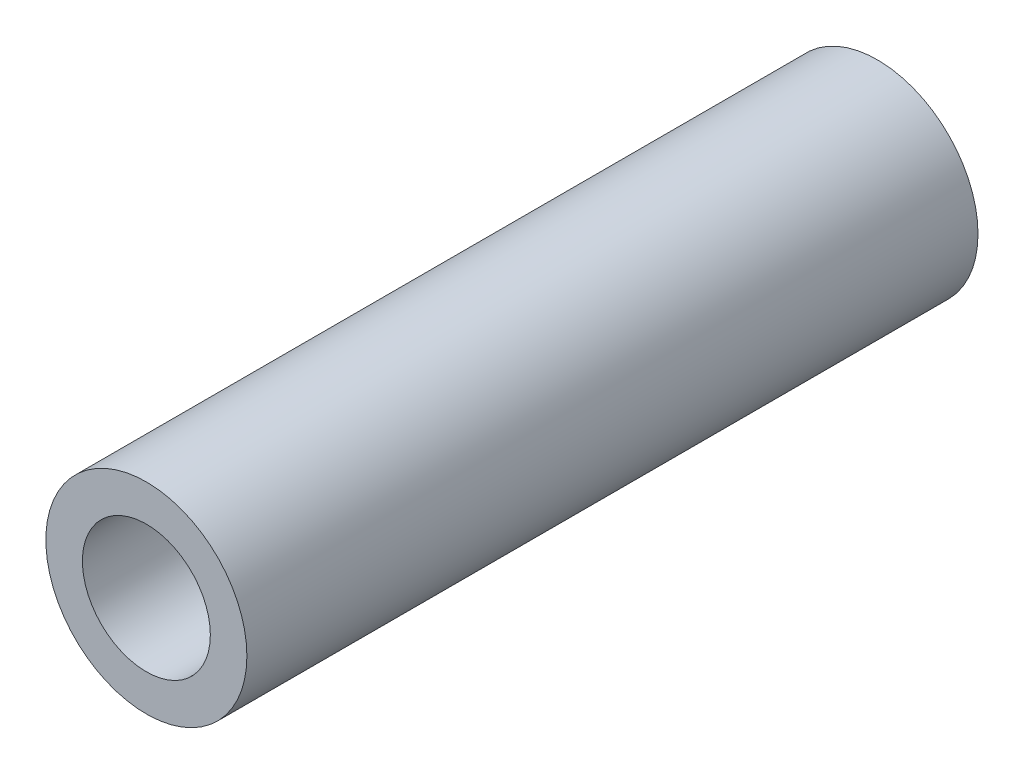
ISO-10303-21;
HEADER;
FILE_DESCRIPTION(('STEP AP214'),'2;1');
FILE_NAME('part.step','',(''),(''),'','','');
FILE_SCHEMA(('AUTOMOTIVE_DESIGN { 1 0 10303 214 1 1 1 1 }'));
ENDSEC;
DATA;
#1=APPLICATION_CONTEXT('core data for automotive mechanical design processes');
#2=APPLICATION_PROTOCOL_DEFINITION('international standard','automotive_design',2000,#1);
#3=PRODUCT_CONTEXT('',#1,'mechanical');
#4=PRODUCT('Part','Part','',(#3));
#5=PRODUCT_RELATED_PRODUCT_CATEGORY('part','',(#4));
#6=PRODUCT_DEFINITION_FORMATION('','',#4);
#7=PRODUCT_DEFINITION_CONTEXT('part definition',#1,'design');
#8=PRODUCT_DEFINITION('design','',#6,#7);
#9=PRODUCT_DEFINITION_SHAPE('','',#8);
#10=(LENGTH_UNIT() NAMED_UNIT(*) SI_UNIT(.MILLI.,.METRE.));
#11=(NAMED_UNIT(*) PLANE_ANGLE_UNIT() SI_UNIT($,.RADIAN.));
#12=(NAMED_UNIT(*) SI_UNIT($,.STERADIAN.) SOLID_ANGLE_UNIT());
#13=UNCERTAINTY_MEASURE_WITH_UNIT(LENGTH_MEASURE(1.E-05),#10,'distance_accuracy_value','');
#14=(GEOMETRIC_REPRESENTATION_CONTEXT(3) GLOBAL_UNCERTAINTY_ASSIGNED_CONTEXT((#13)) GLOBAL_UNIT_ASSIGNED_CONTEXT((#10,
#11,#12)) REPRESENTATION_CONTEXT('',''));
#15=CARTESIAN_POINT('',(0.,0.,0.));
#16=DIRECTION('',(0.,0.,1.));
#17=DIRECTION('',(1.,0.,0.));
#18=AXIS2_PLACEMENT_3D('',#15,#16,#17);
#19=CARTESIAN_POINT('',(0.,0.,20.));
#20=DIRECTION('',(0.,0.,1.));
#21=DIRECTION('',(1.,0.,0.));
#22=AXIS2_PLACEMENT_3D('',#19,#20,#21);
#23=PLANE('',#22);
#24=CARTESIAN_POINT('',(0.,0.,20.));
#25=DIRECTION('',(0.,0.,1.));
#26=DIRECTION('',(1.,0.,0.));
#27=AXIS2_PLACEMENT_3D('',#24,#25,#26);
#28=CIRCLE('',#27,2.75);
#29=CARTESIAN_POINT('',(2.75,0.,20.));
#30=VERTEX_POINT('',#29);
#31=EDGE_CURVE('E10',#30,#30,#28,.T.);
#32=ORIENTED_EDGE('',*,*,#31,.T.);
#33=EDGE_LOOP('',(#32));
#34=FACE_BOUND('',#33,.T.);
#35=CARTESIAN_POINT('',(0.,0.,20.));
#36=DIRECTION('',(0.,0.,1.));
#37=DIRECTION('',(1.,0.,0.));
#38=AXIS2_PLACEMENT_3D('',#35,#36,#37);
#39=CIRCLE('',#38,1.75);
#40=CARTESIAN_POINT('',(1.75,0.,20.));
#41=VERTEX_POINT('',#40);
#42=EDGE_CURVE('E52',#41,#41,#39,.T.);
#43=ORIENTED_EDGE('',*,*,#42,.F.);
#44=EDGE_LOOP('',(#43));
#45=FACE_BOUND('',#44,.T.);
#46=ADVANCED_FACE('F39',(#34,#45),#23,.T.);
#47=CARTESIAN_POINT('',(0.,0.,0.));
#48=DIRECTION('',(0.,0.,1.));
#49=DIRECTION('',(1.,0.,0.));
#50=AXIS2_PLACEMENT_3D('',#47,#48,#49);
#51=PLANE('',#50);
#52=CARTESIAN_POINT('',(0.,0.,0.));
#53=DIRECTION('',(0.,0.,1.));
#54=DIRECTION('',(1.,0.,0.));
#55=AXIS2_PLACEMENT_3D('',#52,#53,#54);
#56=CIRCLE('',#55,2.75);
#57=CARTESIAN_POINT('',(2.75,0.,0.));
#58=VERTEX_POINT('',#57);
#59=EDGE_CURVE('E43',#58,#58,#56,.T.);
#60=ORIENTED_EDGE('',*,*,#59,.F.);
#61=EDGE_LOOP('',(#60));
#62=FACE_BOUND('',#61,.T.);
#63=CARTESIAN_POINT('',(0.,0.,0.));
#64=DIRECTION('',(0.,0.,1.));
#65=DIRECTION('',(1.,0.,0.));
#66=AXIS2_PLACEMENT_3D('',#63,#64,#65);
#67=CIRCLE('',#66,1.75);
#68=CARTESIAN_POINT('',(1.75,0.,0.));
#69=VERTEX_POINT('',#68);
#70=EDGE_CURVE('E54',#69,#69,#67,.T.);
#71=ORIENTED_EDGE('',*,*,#70,.T.);
#72=EDGE_LOOP('',(#71));
#73=FACE_BOUND('',#72,.T.);
#74=ADVANCED_FACE('F66',(#62,#73),#51,.F.);
#75=CARTESIAN_POINT('',(0.,0.,20.));
#76=DIRECTION('',(0.,0.,-1.));
#77=DIRECTION('',(-1.,0.,0.));
#78=AXIS2_PLACEMENT_3D('',#75,#76,#77);
#79=CYLINDRICAL_SURFACE('',#78,2.75);
#80=ORIENTED_EDGE('',*,*,#31,.F.);
#81=EDGE_LOOP('',(#80));
#82=FACE_BOUND('',#81,.T.);
#83=ORIENTED_EDGE('',*,*,#59,.T.);
#84=EDGE_LOOP('',(#83));
#85=FACE_BOUND('',#84,.T.);
#86=ADVANCED_FACE('F41',(#82,#85),#79,.T.);
#87=CARTESIAN_POINT('',(0.,0.,20.));
#88=DIRECTION('',(0.,0.,-1.));
#89=DIRECTION('',(-1.,0.,0.));
#90=AXIS2_PLACEMENT_3D('',#87,#88,#89);
#91=CYLINDRICAL_SURFACE('',#90,1.75);
#92=ORIENTED_EDGE('',*,*,#42,.T.);
#93=EDGE_LOOP('',(#92));
#94=FACE_BOUND('',#93,.T.);
#95=ORIENTED_EDGE('',*,*,#70,.F.);
#96=EDGE_LOOP('',(#95));
#97=FACE_BOUND('',#96,.T.);
#98=ADVANCED_FACE('F62',(#94,#97),#91,.F.);
#99=CLOSED_SHELL('',(#46,#74,#86,#98));
#100=MANIFOLD_SOLID_BREP('B2',#99);
#101=ADVANCED_BREP_SHAPE_REPRESENTATION('',(#18,#100),#14);
#102=SHAPE_DEFINITION_REPRESENTATION(#9,#101);
ENDSEC;
END-ISO-10303-21;
